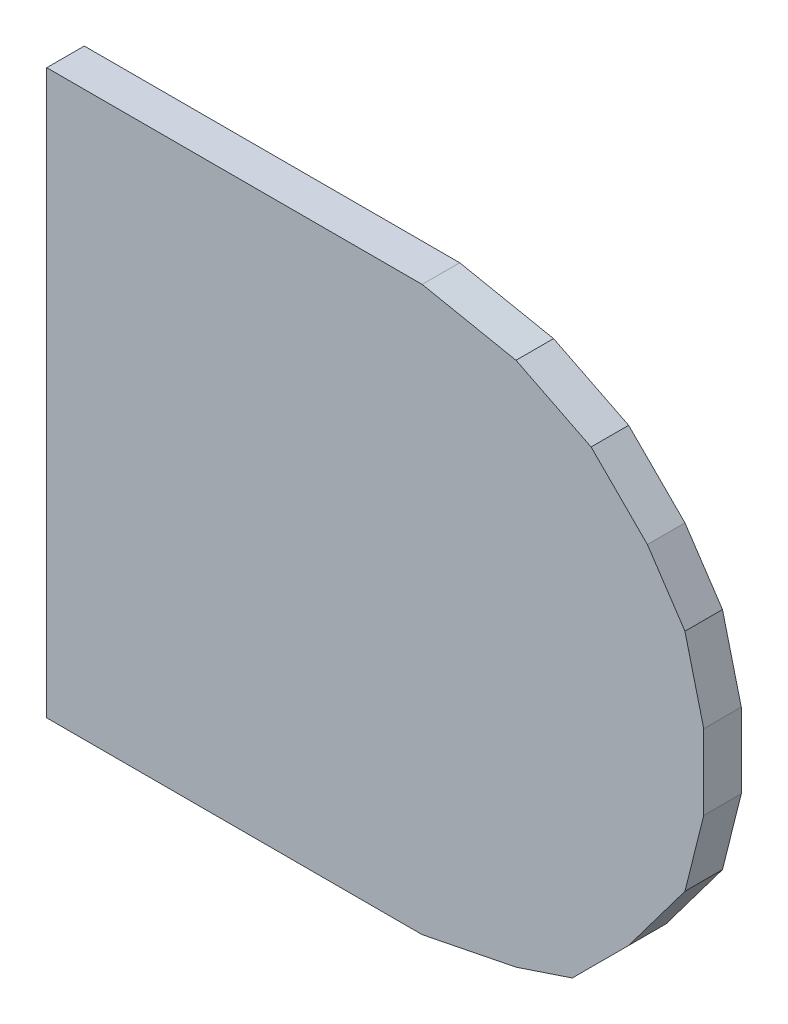
ISO-10303-21;
HEADER;
FILE_DESCRIPTION(('STEP AP214'),'2;1');
FILE_NAME('part.step','',(''),(''),'','','');
FILE_SCHEMA(('AUTOMOTIVE_DESIGN { 1 0 10303 214 1 1 1 1 }'));
ENDSEC;
DATA;
#1=APPLICATION_CONTEXT('core data for automotive mechanical design processes');
#2=APPLICATION_PROTOCOL_DEFINITION('international standard','automotive_design',2000,#1);
#3=PRODUCT_CONTEXT('',#1,'mechanical');
#4=PRODUCT('Part','Part','',(#3));
#5=PRODUCT_RELATED_PRODUCT_CATEGORY('part','',(#4));
#6=PRODUCT_DEFINITION_FORMATION('','',#4);
#7=PRODUCT_DEFINITION_CONTEXT('part definition',#1,'design');
#8=PRODUCT_DEFINITION('design','',#6,#7);
#9=PRODUCT_DEFINITION_SHAPE('','',#8);
#10=(LENGTH_UNIT() NAMED_UNIT(*) SI_UNIT(.MILLI.,.METRE.));
#11=(NAMED_UNIT(*) PLANE_ANGLE_UNIT() SI_UNIT($,.RADIAN.));
#12=(NAMED_UNIT(*) SI_UNIT($,.STERADIAN.) SOLID_ANGLE_UNIT());
#13=UNCERTAINTY_MEASURE_WITH_UNIT(LENGTH_MEASURE(1.E-05),#10,'distance_accuracy_value','');
#14=(GEOMETRIC_REPRESENTATION_CONTEXT(3) GLOBAL_UNCERTAINTY_ASSIGNED_CONTEXT((#13)) GLOBAL_UNIT_ASSIGNED_CONTEXT((#10,
#11,#12)) REPRESENTATION_CONTEXT('',''));
#15=CARTESIAN_POINT('',(0.,0.,0.));
#16=DIRECTION('',(0.,0.,1.));
#17=DIRECTION('',(1.,0.,0.));
#18=AXIS2_PLACEMENT_3D('',#15,#16,#17);
#19=CARTESIAN_POINT('',(-0.17499838,0.1499997,0.02));
#20=DIRECTION('',(0.,0.,1.));
#21=DIRECTION('',(1.,0.,0.));
#22=AXIS2_PLACEMENT_3D('',#19,#20,#21);
#23=PLANE('',#22);
#24=DIRECTION('',(-0.98059025415274,0.196068236745948,0.));
#25=VECTOR('',#24,1.);
#26=CARTESIAN_POINT('',(0.02500121999999,0.1499997,0.02));
#27=LINE('',#26,#25);
#28=CARTESIAN_POINT('',(0.0250012199999903,0.1499997,0.02));
#29=VERTEX_POINT('',#28);
#30=CARTESIAN_POINT('',(0.0750011200000001,0.14000226,0.02));
#31=VERTEX_POINT('',#30);
#32=EDGE_CURVE('E177',#29,#31,#27,.F.);
#33=ORIENTED_EDGE('',*,*,#32,.F.);
#34=DIRECTION('',(1.,0.,0.));
#35=VECTOR('',#34,1.);
#36=CARTESIAN_POINT('',(-0.17499838,0.1499997,0.02));
#37=LINE('',#36,#35);
#38=CARTESIAN_POINT('',(-0.17499838,0.1499997,0.02));
#39=VERTEX_POINT('',#38);
#40=EDGE_CURVE('E130',#39,#29,#37,.T.);
#41=ORIENTED_EDGE('',*,*,#40,.F.);
#42=DIRECTION('',(0.,1.,0.));
#43=VECTOR('',#42,1.);
#44=CARTESIAN_POINT('',(-0.17499838,-0.1499997,0.02));
#45=LINE('',#44,#43);
#46=CARTESIAN_POINT('',(-0.17499838,-0.1499997,0.02));
#47=VERTEX_POINT('',#46);
#48=EDGE_CURVE('E20',#47,#39,#45,.T.);
#49=ORIENTED_EDGE('',*,*,#48,.F.);
#50=DIRECTION('',(1.,0.,0.));
#51=VECTOR('',#50,1.);
#52=CARTESIAN_POINT('',(0.02500121999999,-0.1499997,0.02));
#53=LINE('',#52,#51);
#54=CARTESIAN_POINT('',(0.0250012199999905,-0.149999700000005,0.02));
#55=VERTEX_POINT('',#54);
#56=EDGE_CURVE('E119',#55,#47,#53,.F.);
#57=ORIENTED_EDGE('',*,*,#56,.F.);
#58=DIRECTION('',(0.980571095076593,0.196164032126919,0.));
#59=VECTOR('',#58,1.);
#60=CARTESIAN_POINT('',(0.07500112,-0.13999718,0.02));
#61=LINE('',#60,#59);
#62=CARTESIAN_POINT('',(0.0750011200000007,-0.139997180000002,0.02));
#63=VERTEX_POINT('',#62);
#64=EDGE_CURVE('E114',#63,#55,#61,.F.);
#65=ORIENTED_EDGE('',*,*,#64,.F.);
#66=DIRECTION('',(0.948683298050414,0.316227766017138,0.));
#67=VECTOR('',#66,1.);
#68=CARTESIAN_POINT('',(0.10500106,-0.1299972,0.02));
#69=LINE('',#68,#67);
#70=CARTESIAN_POINT('',(0.105001059999999,-0.129997199999999,0.02));
#71=VERTEX_POINT('',#70);
#72=EDGE_CURVE('E141',#71,#63,#69,.F.);
#73=ORIENTED_EDGE('',*,*,#72,.F.);
#74=DIRECTION('',(0.707106781186548,0.707106781186548,0.));
#75=VECTOR('',#74,1.);
#76=CARTESIAN_POINT('',(0.135001,-0.09999725999999,0.02));
#77=LINE('',#76,#75);
#78=CARTESIAN_POINT('',(0.135001000000001,-0.0999972599999908,0.02));
#79=VERTEX_POINT('',#78);
#80=EDGE_CURVE('E145',#79,#71,#77,.F.);
#81=ORIENTED_EDGE('',*,*,#80,.F.);
#82=DIRECTION('',(0.6,0.8,0.));
#83=VECTOR('',#82,1.);
#84=CARTESIAN_POINT('',(0.16500094,-0.05999734,0.02));
#85=LINE('',#84,#83);
#86=CARTESIAN_POINT('',(0.165000940000002,-0.0599973400000006,0.02));
#87=VERTEX_POINT('',#86);
#88=EDGE_CURVE('E149',#87,#79,#85,.F.);
#89=ORIENTED_EDGE('',*,*,#88,.F.);
#90=DIRECTION('',(0.242535625036098,0.970142500145391,0.));
#91=VECTOR('',#90,1.);
#92=CARTESIAN_POINT('',(0.17500092,-0.01999742,0.02));
#93=LINE('',#92,#91);
#94=CARTESIAN_POINT('',(0.17500092,-0.01999742,0.02));
#95=VERTEX_POINT('',#94);
#96=EDGE_CURVE('E153',#95,#87,#93,.F.);
#97=ORIENTED_EDGE('',*,*,#96,.F.);
#98=DIRECTION('',(0.,1.,0.));
#99=VECTOR('',#98,1.);
#100=CARTESIAN_POINT('',(0.17500092,0.0200025,0.02));
#101=LINE('',#100,#99);
#102=CARTESIAN_POINT('',(0.175000919999998,0.0200024999999991,0.02));
#103=VERTEX_POINT('',#102);
#104=EDGE_CURVE('E157',#103,#95,#101,.F.);
#105=ORIENTED_EDGE('',*,*,#104,.F.);
#106=DIRECTION('',(-0.242535625036098,0.970142500145391,0.));
#107=VECTOR('',#106,1.);
#108=CARTESIAN_POINT('',(0.16500094,0.06000242,0.02));
#109=LINE('',#108,#107);
#110=CARTESIAN_POINT('',(0.165000939999998,0.0600024199999986,0.02));
#111=VERTEX_POINT('',#110);
#112=EDGE_CURVE('E161',#111,#103,#109,.F.);
#113=ORIENTED_EDGE('',*,*,#112,.F.);
#114=DIRECTION('',(-0.554700196224998,0.832050294337997,0.));
#115=VECTOR('',#114,1.);
#116=CARTESIAN_POINT('',(0.14500098,0.09000236,0.02));
#117=LINE('',#116,#115);
#118=CARTESIAN_POINT('',(0.145000979999995,0.0900023599999947,0.02));
#119=VERTEX_POINT('',#118);
#120=EDGE_CURVE('E165',#119,#111,#117,.F.);
#121=ORIENTED_EDGE('',*,*,#120,.F.);
#122=DIRECTION('',(-0.707106781186048,0.707106781187048,0.));
#123=VECTOR('',#122,1.);
#124=CARTESIAN_POINT('',(0.11500104,0.1200023,0.02));
#125=LINE('',#124,#123);
#126=CARTESIAN_POINT('',(0.11500104,0.1200023,0.02));
#127=VERTEX_POINT('',#126);
#128=EDGE_CURVE('E169',#127,#119,#125,.F.);
#129=ORIENTED_EDGE('',*,*,#128,.F.);
#130=DIRECTION('',(-0.894427190999916,0.447213595499958,0.));
#131=VECTOR('',#130,1.);
#132=CARTESIAN_POINT('',(0.07500112,0.14000226,0.02));
#133=LINE('',#132,#131);
#134=EDGE_CURVE('E173',#31,#127,#133,.F.);
#135=ORIENTED_EDGE('',*,*,#134,.F.);
#136=EDGE_LOOP('',(#33,#41,#49,#57,#65,#73,#81,#89,#97,#105,#113,#121,#129,#135));
#137=FACE_BOUND('',#136,.T.);
#138=ADVANCED_FACE('F17',(#137),#23,.T.);
#139=CARTESIAN_POINT('',(-0.17499838,-0.1499997,0.));
#140=DIRECTION('',(-1.,0.,0.));
#141=DIRECTION('',(0.,0.,1.));
#142=AXIS2_PLACEMENT_3D('',#139,#140,#141);
#143=PLANE('',#142);
#144=DIRECTION('',(0.,0.,1.));
#145=VECTOR('',#144,1.);
#146=CARTESIAN_POINT('',(-0.17499838,0.1499997,0.));
#147=LINE('',#146,#145);
#148=CARTESIAN_POINT('',(-0.17499838,0.1499997,0.));
#149=VERTEX_POINT('',#148);
#150=EDGE_CURVE('E181',#149,#39,#147,.T.);
#151=ORIENTED_EDGE('',*,*,#150,.F.);
#152=DIRECTION('',(0.,1.,0.));
#153=VECTOR('',#152,1.);
#154=CARTESIAN_POINT('',(-0.17499838,0.1499997,0.));
#155=LINE('',#154,#153);
#156=CARTESIAN_POINT('',(-0.17499838,-0.1499997,0.));
#157=VERTEX_POINT('',#156);
#158=EDGE_CURVE('E136',#149,#157,#155,.F.);
#159=ORIENTED_EDGE('',*,*,#158,.T.);
#160=DIRECTION('',(0.,0.,-1.));
#161=VECTOR('',#160,1.);
#162=CARTESIAN_POINT('',(-0.17499838,-0.1499997,0.));
#163=LINE('',#162,#161);
#164=EDGE_CURVE('E124',#47,#157,#163,.T.);
#165=ORIENTED_EDGE('',*,*,#164,.F.);
#166=ORIENTED_EDGE('',*,*,#48,.T.);
#167=EDGE_LOOP('',(#151,#159,#165,#166));
#168=FACE_BOUND('',#167,.T.);
#169=ADVANCED_FACE('F135',(#168),#143,.T.);
#170=CARTESIAN_POINT('',(0.02500121999999,-0.1499997,0.));
#171=DIRECTION('',(0.,-1.,0.));
#172=DIRECTION('',(0.,0.,-1.));
#173=AXIS2_PLACEMENT_3D('',#170,#171,#172);
#174=PLANE('',#173);
#175=ORIENTED_EDGE('',*,*,#164,.T.);
#176=DIRECTION('',(1.,0.,0.));
#177=VECTOR('',#176,1.);
#178=CARTESIAN_POINT('',(-0.17499838,-0.1499997,0.));
#179=LINE('',#178,#177);
#180=CARTESIAN_POINT('',(0.0250012199999907,-0.149999700000005,0.));
#181=VERTEX_POINT('',#180);
#182=EDGE_CURVE('E186',#157,#181,#179,.T.);
#183=ORIENTED_EDGE('',*,*,#182,.T.);
#184=DIRECTION('',(0.,0.,1.));
#185=VECTOR('',#184,1.);
#186=CARTESIAN_POINT('',(0.0250012199999938,-0.149999700000019,0.));
#187=LINE('',#186,#185);
#188=EDGE_CURVE('E126',#55,#181,#187,.F.);
#189=ORIENTED_EDGE('',*,*,#188,.F.);
#190=ORIENTED_EDGE('',*,*,#56,.T.);
#191=EDGE_LOOP('',(#175,#183,#189,#190));
#192=FACE_BOUND('',#191,.T.);
#193=ADVANCED_FACE('F121',(#192),#174,.T.);
#194=CARTESIAN_POINT('',(0.07500112,-0.13999718,0.));
#195=DIRECTION('',(0.196164032126919,-0.980571095076593,0.));
#196=DIRECTION('',(0.980571095076593,0.196164032126919,0.));
#197=AXIS2_PLACEMENT_3D('',#194,#195,#196);
#198=PLANE('',#197);
#199=ORIENTED_EDGE('',*,*,#188,.T.);
#200=DIRECTION('',(0.980571095076667,0.196164032126551,0.));
#201=VECTOR('',#200,1.);
#202=CARTESIAN_POINT('',(0.02500121999999,-0.1499997,0.));
#203=LINE('',#202,#201);
#204=CARTESIAN_POINT('',(0.0750011200000008,-0.139997180000002,0.));
#205=VERTEX_POINT('',#204);
#206=EDGE_CURVE('E188',#181,#205,#203,.T.);
#207=ORIENTED_EDGE('',*,*,#206,.T.);
#208=DIRECTION('',(0.,0.,1.));
#209=VECTOR('',#208,1.);
#210=CARTESIAN_POINT('',(0.0750011200000032,-0.139997180000009,0.));
#211=LINE('',#210,#209);
#212=EDGE_CURVE('E143',#63,#205,#211,.F.);
#213=ORIENTED_EDGE('',*,*,#212,.F.);
#214=ORIENTED_EDGE('',*,*,#64,.T.);
#215=EDGE_LOOP('',(#199,#207,#213,#214));
#216=FACE_BOUND('',#215,.T.);
#217=ADVANCED_FACE('F270',(#216),#198,.T.);
#218=CARTESIAN_POINT('',(0.10500106,-0.1299972,0.));
#219=DIRECTION('',(0.316227766017138,-0.948683298050414,0.));
#220=DIRECTION('',(0.948683298050414,0.316227766017138,0.));
#221=AXIS2_PLACEMENT_3D('',#218,#219,#220);
#222=PLANE('',#221);
#223=ORIENTED_EDGE('',*,*,#212,.T.);
#224=DIRECTION('',(0.948683298050514,0.316227766016838,0.));
#225=VECTOR('',#224,1.);
#226=CARTESIAN_POINT('',(0.07500112,-0.13999718,0.));
#227=LINE('',#226,#225);
#228=CARTESIAN_POINT('',(0.105001059999999,-0.129997199999999,0.));
#229=VERTEX_POINT('',#228);
#230=EDGE_CURVE('E191',#205,#229,#227,.T.);
#231=ORIENTED_EDGE('',*,*,#230,.T.);
#232=DIRECTION('',(0.,0.,1.));
#233=VECTOR('',#232,1.);
#234=CARTESIAN_POINT('',(0.105001059999995,-0.129997199999995,0.));
#235=LINE('',#234,#233);
#236=EDGE_CURVE('E147',#71,#229,#235,.F.);
#237=ORIENTED_EDGE('',*,*,#236,.F.);
#238=ORIENTED_EDGE('',*,*,#72,.T.);
#239=EDGE_LOOP('',(#223,#231,#237,#238));
#240=FACE_BOUND('',#239,.T.);
#241=ADVANCED_FACE('F269',(#240),#222,.T.);
#242=CARTESIAN_POINT('',(0.135001,-0.09999725999999,0.));
#243=DIRECTION('',(0.707106781186548,-0.707106781186548,0.));
#244=DIRECTION('',(0.707106781186548,0.707106781186548,0.));
#245=AXIS2_PLACEMENT_3D('',#242,#243,#244);
#246=PLANE('',#245);
#247=ORIENTED_EDGE('',*,*,#236,.T.);
#248=DIRECTION('',(0.70710678118643,0.707106781186665,0.));
#249=VECTOR('',#248,1.);
#250=CARTESIAN_POINT('',(0.10500106,-0.1299972,0.));
#251=LINE('',#250,#249);
#252=CARTESIAN_POINT('',(0.135001000000001,-0.0999972599999909,0.));
#253=VERTEX_POINT('',#252);
#254=EDGE_CURVE('E194',#229,#253,#251,.T.);
#255=ORIENTED_EDGE('',*,*,#254,.T.);
#256=DIRECTION('',(0.,0.,1.));
#257=VECTOR('',#256,1.);
#258=CARTESIAN_POINT('',(0.135001000000005,-0.0999972599999936,0.));
#259=LINE('',#258,#257);
#260=EDGE_CURVE('E151',#79,#253,#259,.F.);
#261=ORIENTED_EDGE('',*,*,#260,.F.);
#262=ORIENTED_EDGE('',*,*,#80,.T.);
#263=EDGE_LOOP('',(#247,#255,#261,#262));
#264=FACE_BOUND('',#263,.T.);
#265=ADVANCED_FACE('F263',(#264),#246,.T.);
#266=CARTESIAN_POINT('',(0.16500094,-0.05999734,0.));
#267=DIRECTION('',(0.8,-0.6,0.));
#268=DIRECTION('',(0.6,0.8,0.));
#269=AXIS2_PLACEMENT_3D('',#266,#267,#268);
#270=PLANE('',#269);
#271=ORIENTED_EDGE('',*,*,#260,.T.);
#272=DIRECTION('',(0.600000000000096,0.799999999999928,0.));
#273=VECTOR('',#272,1.);
#274=CARTESIAN_POINT('',(0.135001,-0.09999725999999,0.));
#275=LINE('',#274,#273);
#276=CARTESIAN_POINT('',(0.165000940000002,-0.0599973400000006,0.));
#277=VERTEX_POINT('',#276);
#278=EDGE_CURVE('E197',#253,#277,#275,.T.);
#279=ORIENTED_EDGE('',*,*,#278,.T.);
#280=DIRECTION('',(0.,0.,1.));
#281=VECTOR('',#280,1.);
#282=CARTESIAN_POINT('',(0.16500094000001,-0.0599973400000024,0.));
#283=LINE('',#282,#281);
#284=EDGE_CURVE('E155',#87,#277,#283,.F.);
#285=ORIENTED_EDGE('',*,*,#284,.F.);
#286=ORIENTED_EDGE('',*,*,#88,.T.);
#287=EDGE_LOOP('',(#271,#279,#285,#286));
#288=FACE_BOUND('',#287,.T.);
#289=ADVANCED_FACE('F259',(#288),#270,.T.);
#290=CARTESIAN_POINT('',(0.17500092,-0.01999742,0.));
#291=DIRECTION('',(0.970142500145391,-0.242535625036098,0.));
#292=DIRECTION('',(0.242535625036098,0.970142500145391,0.));
#293=AXIS2_PLACEMENT_3D('',#290,#291,#292);
#294=PLANE('',#293);
#295=ORIENTED_EDGE('',*,*,#284,.T.);
#296=DIRECTION('',(0.242535625036333,0.970142500145332,0.));
#297=VECTOR('',#296,1.);
#298=CARTESIAN_POINT('',(0.16500094,-0.05999734,0.));
#299=LINE('',#298,#297);
#300=CARTESIAN_POINT('',(0.17500092,-0.01999742,0.));
#301=VERTEX_POINT('',#300);
#302=EDGE_CURVE('E200',#277,#301,#299,.T.);
#303=ORIENTED_EDGE('',*,*,#302,.T.);
#304=DIRECTION('',(0.,0.,-1.));
#305=VECTOR('',#304,1.);
#306=CARTESIAN_POINT('',(0.17500092,-0.01999742,0.));
#307=LINE('',#306,#305);
#308=EDGE_CURVE('E159',#95,#301,#307,.T.);
#309=ORIENTED_EDGE('',*,*,#308,.F.);
#310=ORIENTED_EDGE('',*,*,#96,.T.);
#311=EDGE_LOOP('',(#295,#303,#309,#310));
#312=FACE_BOUND('',#311,.T.);
#313=ADVANCED_FACE('F253',(#312),#294,.T.);
#314=CARTESIAN_POINT('',(0.17500092,0.0200025,0.));
#315=DIRECTION('',(1.,0.,0.));
#316=DIRECTION('',(0.,0.,-1.));
#317=AXIS2_PLACEMENT_3D('',#314,#315,#316);
#318=PLANE('',#317);
#319=ORIENTED_EDGE('',*,*,#308,.T.);
#320=DIRECTION('',(0.,1.,0.));
#321=VECTOR('',#320,1.);
#322=CARTESIAN_POINT('',(0.17500092,0.1499997,0.));
#323=LINE('',#322,#321);
#324=CARTESIAN_POINT('',(0.175000919999998,0.0200024999999992,0.));
#325=VERTEX_POINT('',#324);
#326=EDGE_CURVE('E203',#301,#325,#323,.T.);
#327=ORIENTED_EDGE('',*,*,#326,.T.);
#328=DIRECTION('',(0.,0.,1.));
#329=VECTOR('',#328,1.);
#330=CARTESIAN_POINT('',(0.17500091999999,0.0200024999999976,0.));
#331=LINE('',#330,#329);
#332=EDGE_CURVE('E163',#103,#325,#331,.F.);
#333=ORIENTED_EDGE('',*,*,#332,.F.);
#334=ORIENTED_EDGE('',*,*,#104,.T.);
#335=EDGE_LOOP('',(#319,#327,#333,#334));
#336=FACE_BOUND('',#335,.T.);
#337=ADVANCED_FACE('F249',(#336),#318,.T.);
#338=CARTESIAN_POINT('',(0.16500094,0.06000242,0.));
#339=DIRECTION('',(0.970142500145391,0.242535625036098,0.));
#340=DIRECTION('',(-0.242535625036098,0.970142500145391,0.));
#341=AXIS2_PLACEMENT_3D('',#338,#339,#340);
#342=PLANE('',#341);
#343=ORIENTED_EDGE('',*,*,#332,.T.);
#344=DIRECTION('',(-0.242535625036333,0.970142500145332,0.));
#345=VECTOR('',#344,1.);
#346=CARTESIAN_POINT('',(0.17500092,0.0200025,0.));
#347=LINE('',#346,#345);
#348=CARTESIAN_POINT('',(0.165000939999998,0.0600024199999986,0.));
#349=VERTEX_POINT('',#348);
#350=EDGE_CURVE('E206',#325,#349,#347,.T.);
#351=ORIENTED_EDGE('',*,*,#350,.T.);
#352=DIRECTION('',(0.,0.,1.));
#353=VECTOR('',#352,1.);
#354=CARTESIAN_POINT('',(0.165000939999992,0.0600024199999945,0.));
#355=LINE('',#354,#353);
#356=EDGE_CURVE('E167',#111,#349,#355,.F.);
#357=ORIENTED_EDGE('',*,*,#356,.F.);
#358=ORIENTED_EDGE('',*,*,#112,.T.);
#359=EDGE_LOOP('',(#343,#351,#357,#358));
#360=FACE_BOUND('',#359,.T.);
#361=ADVANCED_FACE('F243',(#360),#342,.T.);
#362=CARTESIAN_POINT('',(0.14500098,0.09000236,0.));
#363=DIRECTION('',(0.832050294337997,0.554700196224998,0.));
#364=DIRECTION('',(-0.554700196224998,0.832050294337997,0.));
#365=AXIS2_PLACEMENT_3D('',#362,#363,#364);
#366=PLANE('',#365);
#367=ORIENTED_EDGE('',*,*,#356,.T.);
#368=DIRECTION('',(-0.554700196225229,0.832050294337844,0.));
#369=VECTOR('',#368,1.);
#370=CARTESIAN_POINT('',(0.16500094,0.06000242,0.));
#371=LINE('',#370,#369);
#372=CARTESIAN_POINT('',(0.145000979999995,0.0900023599999947,0.));
#373=VERTEX_POINT('',#372);
#374=EDGE_CURVE('E209',#349,#373,#371,.T.);
#375=ORIENTED_EDGE('',*,*,#374,.T.);
#376=DIRECTION('',(0.,0.,1.));
#377=VECTOR('',#376,1.);
#378=CARTESIAN_POINT('',(0.145000979999979,0.0900023599999788,0.));
#379=LINE('',#378,#377);
#380=EDGE_CURVE('E171',#119,#373,#379,.F.);
#381=ORIENTED_EDGE('',*,*,#380,.F.);
#382=ORIENTED_EDGE('',*,*,#120,.T.);
#383=EDGE_LOOP('',(#367,#375,#381,#382));
#384=FACE_BOUND('',#383,.T.);
#385=ADVANCED_FACE('F239',(#384),#366,.T.);
#386=CARTESIAN_POINT('',(0.11500104,0.1200023,0.));
#387=DIRECTION('',(0.707106781187048,0.707106781186048,0.));
#388=DIRECTION('',(-0.707106781186048,0.707106781187048,0.));
#389=AXIS2_PLACEMENT_3D('',#386,#387,#388);
#390=PLANE('',#389);
#391=ORIENTED_EDGE('',*,*,#380,.T.);
#392=DIRECTION('',(-0.707106781186547,0.707106781186548,0.));
#393=VECTOR('',#392,1.);
#394=CARTESIAN_POINT('',(0.14500098,0.09000236,0.));
#395=LINE('',#394,#393);
#396=CARTESIAN_POINT('',(0.11500104,0.1200023,0.));
#397=VERTEX_POINT('',#396);
#398=EDGE_CURVE('E212',#373,#397,#395,.T.);
#399=ORIENTED_EDGE('',*,*,#398,.T.);
#400=DIRECTION('',(0.,0.,1.));
#401=VECTOR('',#400,1.);
#402=CARTESIAN_POINT('',(0.11500104,0.1200023,0.));
#403=LINE('',#402,#401);
#404=EDGE_CURVE('E175',#127,#397,#403,.F.);
#405=ORIENTED_EDGE('',*,*,#404,.F.);
#406=ORIENTED_EDGE('',*,*,#128,.T.);
#407=EDGE_LOOP('',(#391,#399,#405,#406));
#408=FACE_BOUND('',#407,.T.);
#409=ADVANCED_FACE('F233',(#408),#390,.T.);
#410=CARTESIAN_POINT('',(0.07500112,0.14000226,0.));
#411=DIRECTION('',(0.447213595499958,0.894427190999916,0.));
#412=DIRECTION('',(-0.894427190999916,0.447213595499958,0.));
#413=AXIS2_PLACEMENT_3D('',#410,#411,#412);
#414=PLANE('',#413);
#415=ORIENTED_EDGE('',*,*,#404,.T.);
#416=DIRECTION('',(-0.894427190999916,0.447213595499957,0.));
#417=VECTOR('',#416,1.);
#418=CARTESIAN_POINT('',(0.11500104,0.1200023,0.));
#419=LINE('',#418,#417);
#420=CARTESIAN_POINT('',(0.0750011200000001,0.14000226,0.));
#421=VERTEX_POINT('',#420);
#422=EDGE_CURVE('E215',#397,#421,#419,.T.);
#423=ORIENTED_EDGE('',*,*,#422,.T.);
#424=DIRECTION('',(0.,0.,1.));
#425=VECTOR('',#424,1.);
#426=CARTESIAN_POINT('',(0.0750011200000002,0.140002260000001,0.));
#427=LINE('',#426,#425);
#428=EDGE_CURVE('E179',#31,#421,#427,.F.);
#429=ORIENTED_EDGE('',*,*,#428,.F.);
#430=ORIENTED_EDGE('',*,*,#134,.T.);
#431=EDGE_LOOP('',(#415,#423,#429,#430));
#432=FACE_BOUND('',#431,.T.);
#433=ADVANCED_FACE('F228',(#432),#414,.T.);
#434=CARTESIAN_POINT('',(0.02500121999999,0.1499997,0.));
#435=DIRECTION('',(0.196068236745948,0.98059025415274,0.));
#436=DIRECTION('',(-0.98059025415274,0.196068236745948,0.));
#437=AXIS2_PLACEMENT_3D('',#434,#435,#436);
#438=PLANE('',#437);
#439=ORIENTED_EDGE('',*,*,#428,.T.);
#440=DIRECTION('',(-0.980590254152736,0.196068236745969,0.));
#441=VECTOR('',#440,1.);
#442=CARTESIAN_POINT('',(0.07500112,0.14000226,0.));
#443=LINE('',#442,#441);
#444=CARTESIAN_POINT('',(0.0250012199999901,0.1499997,0.));
#445=VERTEX_POINT('',#444);
#446=EDGE_CURVE('E26',#421,#445,#443,.T.);
#447=ORIENTED_EDGE('',*,*,#446,.T.);
#448=DIRECTION('',(0.,0.,1.));
#449=VECTOR('',#448,1.);
#450=CARTESIAN_POINT('',(0.02500121999999,0.1499997,0.));
#451=LINE('',#450,#449);
#452=EDGE_CURVE('E34',#29,#445,#451,.F.);
#453=ORIENTED_EDGE('',*,*,#452,.F.);
#454=ORIENTED_EDGE('',*,*,#32,.T.);
#455=EDGE_LOOP('',(#439,#447,#453,#454));
#456=FACE_BOUND('',#455,.T.);
#457=ADVANCED_FACE('F221',(#456),#438,.T.);
#458=CARTESIAN_POINT('',(-0.17499838,0.1499997,0.));
#459=DIRECTION('',(0.,1.,0.));
#460=DIRECTION('',(0.,0.,1.));
#461=AXIS2_PLACEMENT_3D('',#458,#459,#460);
#462=PLANE('',#461);
#463=ORIENTED_EDGE('',*,*,#452,.T.);
#464=DIRECTION('',(1.,0.,0.));
#465=VECTOR('',#464,1.);
#466=CARTESIAN_POINT('',(-0.17499838,0.1499997,0.));
#467=LINE('',#466,#465);
#468=EDGE_CURVE('E11',#445,#149,#467,.F.);
#469=ORIENTED_EDGE('',*,*,#468,.T.);
#470=ORIENTED_EDGE('',*,*,#150,.T.);
#471=ORIENTED_EDGE('',*,*,#40,.T.);
#472=EDGE_LOOP('',(#463,#469,#470,#471));
#473=FACE_BOUND('',#472,.T.);
#474=ADVANCED_FACE('F271',(#473),#462,.T.);
#475=CARTESIAN_POINT('',(-0.17499838,0.1499997,0.));
#476=DIRECTION('',(0.,0.,1.));
#477=DIRECTION('',(1.,0.,0.));
#478=AXIS2_PLACEMENT_3D('',#475,#476,#477);
#479=PLANE('',#478);
#480=ORIENTED_EDGE('',*,*,#446,.F.);
#481=ORIENTED_EDGE('',*,*,#422,.F.);
#482=ORIENTED_EDGE('',*,*,#398,.F.);
#483=ORIENTED_EDGE('',*,*,#374,.F.);
#484=ORIENTED_EDGE('',*,*,#350,.F.);
#485=ORIENTED_EDGE('',*,*,#326,.F.);
#486=ORIENTED_EDGE('',*,*,#302,.F.);
#487=ORIENTED_EDGE('',*,*,#278,.F.);
#488=ORIENTED_EDGE('',*,*,#254,.F.);
#489=ORIENTED_EDGE('',*,*,#230,.F.);
#490=ORIENTED_EDGE('',*,*,#206,.F.);
#491=ORIENTED_EDGE('',*,*,#182,.F.);
#492=ORIENTED_EDGE('',*,*,#158,.F.);
#493=ORIENTED_EDGE('',*,*,#468,.F.);
#494=EDGE_LOOP('',(#480,#481,#482,#483,#484,#485,#486,#487,#488,#489,#490,#491,#492,#493));
#495=FACE_BOUND('',#494,.T.);
#496=ADVANCED_FACE('F225',(#495),#479,.F.);
#497=CLOSED_SHELL('',(#138,#169,#193,#217,#241,#265,#289,#313,#337,#361,#385,#409,#433,#457,
#474,#496));
#498=MANIFOLD_SOLID_BREP('B1',#497);
#499=ADVANCED_BREP_SHAPE_REPRESENTATION('',(#18,#498),#14);
#500=SHAPE_DEFINITION_REPRESENTATION(#9,#499);
ENDSEC;
END-ISO-10303-21;
